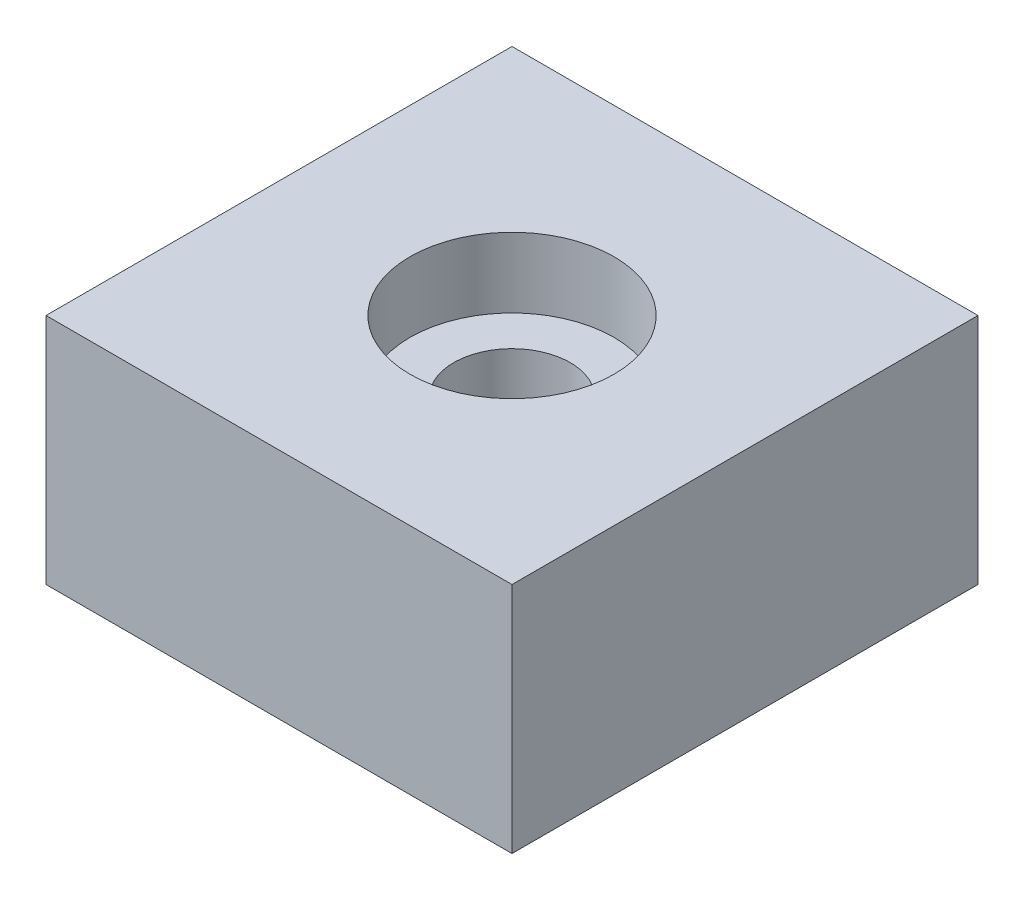
ISO-10303-21;
HEADER;
FILE_DESCRIPTION(('STEP AP214'),'2;1');
FILE_NAME('part.step','',(''),(''),'','','');
FILE_SCHEMA(('AUTOMOTIVE_DESIGN { 1 0 10303 214 1 1 1 1 }'));
ENDSEC;
DATA;
#1=APPLICATION_CONTEXT('core data for automotive mechanical design processes');
#2=APPLICATION_PROTOCOL_DEFINITION('international standard','automotive_design',2000,#1);
#3=PRODUCT_CONTEXT('',#1,'mechanical');
#4=PRODUCT('Part','Part','',(#3));
#5=PRODUCT_RELATED_PRODUCT_CATEGORY('part','',(#4));
#6=PRODUCT_DEFINITION_FORMATION('','',#4);
#7=PRODUCT_DEFINITION_CONTEXT('part definition',#1,'design');
#8=PRODUCT_DEFINITION('design','',#6,#7);
#9=PRODUCT_DEFINITION_SHAPE('','',#8);
#10=(LENGTH_UNIT() NAMED_UNIT(*) SI_UNIT(.MILLI.,.METRE.));
#11=(NAMED_UNIT(*) PLANE_ANGLE_UNIT() SI_UNIT($,.RADIAN.));
#12=(NAMED_UNIT(*) SI_UNIT($,.STERADIAN.) SOLID_ANGLE_UNIT());
#13=UNCERTAINTY_MEASURE_WITH_UNIT(LENGTH_MEASURE(1.E-05),#10,'distance_accuracy_value','');
#14=(GEOMETRIC_REPRESENTATION_CONTEXT(3) GLOBAL_UNCERTAINTY_ASSIGNED_CONTEXT((#13)) GLOBAL_UNIT_ASSIGNED_CONTEXT((#10,
#11,#12)) REPRESENTATION_CONTEXT('',''));
#15=CARTESIAN_POINT('',(0.,0.,0.));
#16=DIRECTION('',(0.,0.,1.));
#17=DIRECTION('',(1.,0.,0.));
#18=AXIS2_PLACEMENT_3D('',#15,#16,#17);
#19=CARTESIAN_POINT('',(25.4,0.,-25.4));
#20=DIRECTION('',(0.,1.,0.));
#21=DIRECTION('',(0.,0.,1.));
#22=AXIS2_PLACEMENT_3D('',#19,#20,#21);
#23=CYLINDRICAL_SURFACE('',#22,6.35);
#24=CARTESIAN_POINT('',(25.4,0.,-25.4));
#25=DIRECTION('',(0.,1.,0.));
#26=DIRECTION('',(0.,0.,1.));
#27=AXIS2_PLACEMENT_3D('',#24,#25,#26);
#28=CIRCLE('',#27,6.35);
#29=CARTESIAN_POINT('',(25.4,0.,-19.05));
#30=VERTEX_POINT('',#29);
#31=EDGE_CURVE('E121',#30,#30,#28,.T.);
#32=ORIENTED_EDGE('',*,*,#31,.F.);
#33=EDGE_LOOP('',(#32));
#34=FACE_BOUND('',#33,.T.);
#35=CARTESIAN_POINT('',(25.4,17.78,-25.4));
#36=DIRECTION('',(0.,1.,0.));
#37=DIRECTION('',(0.,0.,1.));
#38=AXIS2_PLACEMENT_3D('',#35,#36,#37);
#39=CIRCLE('',#38,6.35);
#40=CARTESIAN_POINT('',(25.4,17.78,-19.05));
#41=VERTEX_POINT('',#40);
#42=EDGE_CURVE('E48',#41,#41,#39,.F.);
#43=ORIENTED_EDGE('',*,*,#42,.F.);
#44=EDGE_LOOP('',(#43));
#45=FACE_BOUND('',#44,.T.);
#46=ADVANCED_FACE('F44',(#34,#45),#23,.F.);
#47=CARTESIAN_POINT('',(0.,25.4,0.));
#48=DIRECTION('',(1.,0.,0.));
#49=DIRECTION('',(0.,0.,-1.));
#50=AXIS2_PLACEMENT_3D('',#47,#48,#49);
#51=PLANE('',#50);
#52=DIRECTION('',(0.,0.,1.));
#53=VECTOR('',#52,1.);
#54=CARTESIAN_POINT('',(0.,0.,0.));
#55=LINE('',#54,#53);
#56=CARTESIAN_POINT('',(0.,0.,-50.8));
#57=VERTEX_POINT('',#56);
#58=CARTESIAN_POINT('',(0.,0.,0.));
#59=VERTEX_POINT('',#58);
#60=EDGE_CURVE('E117',#57,#59,#55,.T.);
#61=ORIENTED_EDGE('',*,*,#60,.T.);
#62=DIRECTION('',(0.,-1.,0.));
#63=VECTOR('',#62,1.);
#64=CARTESIAN_POINT('',(0.,25.4,0.));
#65=LINE('',#64,#63);
#66=CARTESIAN_POINT('',(0.,25.4,0.));
#67=VERTEX_POINT('',#66);
#68=EDGE_CURVE('E11',#67,#59,#65,.T.);
#69=ORIENTED_EDGE('',*,*,#68,.F.);
#70=DIRECTION('',(0.,0.,1.));
#71=VECTOR('',#70,1.);
#72=CARTESIAN_POINT('',(0.,25.4,0.));
#73=LINE('',#72,#71);
#74=CARTESIAN_POINT('',(0.,25.4,-50.8));
#75=VERTEX_POINT('',#74);
#76=EDGE_CURVE('E98',#75,#67,#73,.T.);
#77=ORIENTED_EDGE('',*,*,#76,.F.);
#78=DIRECTION('',(0.,-1.,0.));
#79=VECTOR('',#78,1.);
#80=CARTESIAN_POINT('',(0.,25.4,-50.8));
#81=LINE('',#80,#79);
#82=EDGE_CURVE('E113',#75,#57,#81,.T.);
#83=ORIENTED_EDGE('',*,*,#82,.T.);
#84=EDGE_LOOP('',(#61,#69,#77,#83));
#85=FACE_BOUND('',#84,.T.);
#86=ADVANCED_FACE('F46',(#85),#51,.F.);
#87=CARTESIAN_POINT('',(0.,25.4,0.));
#88=DIRECTION('',(0.,0.,-1.));
#89=DIRECTION('',(-1.,0.,0.));
#90=AXIS2_PLACEMENT_3D('',#87,#88,#89);
#91=PLANE('',#90);
#92=DIRECTION('',(1.,0.,0.));
#93=VECTOR('',#92,1.);
#94=CARTESIAN_POINT('',(0.,0.,0.));
#95=LINE('',#94,#93);
#96=CARTESIAN_POINT('',(50.8,0.,0.));
#97=VERTEX_POINT('',#96);
#98=EDGE_CURVE('E103',#59,#97,#95,.T.);
#99=ORIENTED_EDGE('',*,*,#98,.T.);
#100=DIRECTION('',(0.,-1.,0.));
#101=VECTOR('',#100,1.);
#102=CARTESIAN_POINT('',(50.8,25.4,0.));
#103=LINE('',#102,#101);
#104=CARTESIAN_POINT('',(50.8,25.4,0.));
#105=VERTEX_POINT('',#104);
#106=EDGE_CURVE('E55',#105,#97,#103,.T.);
#107=ORIENTED_EDGE('',*,*,#106,.F.);
#108=DIRECTION('',(1.,0.,0.));
#109=VECTOR('',#108,1.);
#110=CARTESIAN_POINT('',(0.,25.4,0.));
#111=LINE('',#110,#109);
#112=EDGE_CURVE('E93',#67,#105,#111,.T.);
#113=ORIENTED_EDGE('',*,*,#112,.F.);
#114=ORIENTED_EDGE('',*,*,#68,.T.);
#115=EDGE_LOOP('',(#99,#107,#113,#114));
#116=FACE_BOUND('',#115,.T.);
#117=ADVANCED_FACE('F102',(#116),#91,.F.);
#118=CARTESIAN_POINT('',(50.8,25.4,0.));
#119=DIRECTION('',(-1.,0.,0.));
#120=DIRECTION('',(0.,0.,1.));
#121=AXIS2_PLACEMENT_3D('',#118,#119,#120);
#122=PLANE('',#121);
#123=DIRECTION('',(0.,0.,-1.));
#124=VECTOR('',#123,1.);
#125=CARTESIAN_POINT('',(50.8,0.,0.));
#126=LINE('',#125,#124);
#127=CARTESIAN_POINT('',(50.8,0.,-50.8));
#128=VERTEX_POINT('',#127);
#129=EDGE_CURVE('E80',#97,#128,#126,.T.);
#130=ORIENTED_EDGE('',*,*,#129,.T.);
#131=DIRECTION('',(0.,-1.,0.));
#132=VECTOR('',#131,1.);
#133=CARTESIAN_POINT('',(50.8,25.4,-50.8));
#134=LINE('',#133,#132);
#135=CARTESIAN_POINT('',(50.8,25.4,-50.8));
#136=VERTEX_POINT('',#135);
#137=EDGE_CURVE('E105',#136,#128,#134,.T.);
#138=ORIENTED_EDGE('',*,*,#137,.F.);
#139=DIRECTION('',(0.,0.,-1.));
#140=VECTOR('',#139,1.);
#141=CARTESIAN_POINT('',(50.8,25.4,0.));
#142=LINE('',#141,#140);
#143=EDGE_CURVE('E96',#105,#136,#142,.T.);
#144=ORIENTED_EDGE('',*,*,#143,.F.);
#145=ORIENTED_EDGE('',*,*,#106,.T.);
#146=EDGE_LOOP('',(#130,#138,#144,#145));
#147=FACE_BOUND('',#146,.T.);
#148=ADVANCED_FACE('F107',(#147),#122,.F.);
#149=CARTESIAN_POINT('',(0.,25.4,-50.8));
#150=DIRECTION('',(0.,0.,1.));
#151=DIRECTION('',(1.,0.,0.));
#152=AXIS2_PLACEMENT_3D('',#149,#150,#151);
#153=PLANE('',#152);
#154=DIRECTION('',(-1.,0.,0.));
#155=VECTOR('',#154,1.);
#156=CARTESIAN_POINT('',(0.,0.,-50.8));
#157=LINE('',#156,#155);
#158=EDGE_CURVE('E86',#128,#57,#157,.T.);
#159=ORIENTED_EDGE('',*,*,#158,.T.);
#160=ORIENTED_EDGE('',*,*,#82,.F.);
#161=DIRECTION('',(-1.,0.,0.));
#162=VECTOR('',#161,1.);
#163=CARTESIAN_POINT('',(0.,25.4,-50.8));
#164=LINE('',#163,#162);
#165=EDGE_CURVE('E63',#136,#75,#164,.T.);
#166=ORIENTED_EDGE('',*,*,#165,.F.);
#167=ORIENTED_EDGE('',*,*,#137,.T.);
#168=EDGE_LOOP('',(#159,#160,#166,#167));
#169=FACE_BOUND('',#168,.T.);
#170=ADVANCED_FACE('F133',(#169),#153,.F.);
#171=CARTESIAN_POINT('',(0.,25.4,0.));
#172=DIRECTION('',(0.,-1.,0.));
#173=DIRECTION('',(0.,0.,-1.));
#174=AXIS2_PLACEMENT_3D('',#171,#172,#173);
#175=PLANE('',#174);
#176=CARTESIAN_POINT('',(25.4,25.4,-25.4));
#177=DIRECTION('',(0.,1.,0.));
#178=DIRECTION('',(0.,0.,1.));
#179=AXIS2_PLACEMENT_3D('',#176,#177,#178);
#180=CIRCLE('',#179,11.1125);
#181=CARTESIAN_POINT('',(25.4,25.4,-14.2875));
#182=VERTEX_POINT('',#181);
#183=EDGE_CURVE('E145',#182,#182,#180,.T.);
#184=ORIENTED_EDGE('',*,*,#183,.F.);
#185=EDGE_LOOP('',(#184));
#186=FACE_BOUND('',#185,.T.);
#187=ORIENTED_EDGE('',*,*,#76,.T.);
#188=ORIENTED_EDGE('',*,*,#112,.T.);
#189=ORIENTED_EDGE('',*,*,#143,.T.);
#190=ORIENTED_EDGE('',*,*,#165,.T.);
#191=EDGE_LOOP('',(#187,#188,#189,#190));
#192=FACE_BOUND('',#191,.T.);
#193=ADVANCED_FACE('F94',(#186,#192),#175,.F.);
#194=CARTESIAN_POINT('',(0.,0.,0.));
#195=DIRECTION('',(0.,-1.,0.));
#196=DIRECTION('',(0.,0.,-1.));
#197=AXIS2_PLACEMENT_3D('',#194,#195,#196);
#198=PLANE('',#197);
#199=ORIENTED_EDGE('',*,*,#31,.T.);
#200=EDGE_LOOP('',(#199));
#201=FACE_BOUND('',#200,.T.);
#202=ORIENTED_EDGE('',*,*,#60,.F.);
#203=ORIENTED_EDGE('',*,*,#158,.F.);
#204=ORIENTED_EDGE('',*,*,#129,.F.);
#205=ORIENTED_EDGE('',*,*,#98,.F.);
#206=EDGE_LOOP('',(#202,#203,#204,#205));
#207=FACE_BOUND('',#206,.T.);
#208=ADVANCED_FACE('F136',(#201,#207),#198,.T.);
#209=CARTESIAN_POINT('',(25.4,17.78,-25.4));
#210=DIRECTION('',(0.,1.,0.));
#211=DIRECTION('',(0.,0.,1.));
#212=AXIS2_PLACEMENT_3D('',#209,#210,#211);
#213=PLANE('',#212);
#214=CARTESIAN_POINT('',(25.4,17.78,-25.4));
#215=DIRECTION('',(0.,1.,0.));
#216=DIRECTION('',(0.,0.,1.));
#217=AXIS2_PLACEMENT_3D('',#214,#215,#216);
#218=CIRCLE('',#217,11.1125);
#219=CARTESIAN_POINT('',(25.4,17.78,-14.2875));
#220=VERTEX_POINT('',#219);
#221=EDGE_CURVE('E149',#220,#220,#218,.T.);
#222=ORIENTED_EDGE('',*,*,#221,.T.);
#223=EDGE_LOOP('',(#222));
#224=FACE_BOUND('',#223,.T.);
#225=ORIENTED_EDGE('',*,*,#42,.T.);
#226=EDGE_LOOP('',(#225));
#227=FACE_BOUND('',#226,.T.);
#228=ADVANCED_FACE('F162',(#224,#227),#213,.T.);
#229=CARTESIAN_POINT('',(25.4,17.78,-25.4));
#230=DIRECTION('',(0.,1.,0.));
#231=DIRECTION('',(0.,0.,1.));
#232=AXIS2_PLACEMENT_3D('',#229,#230,#231);
#233=CYLINDRICAL_SURFACE('',#232,11.1125);
#234=ORIENTED_EDGE('',*,*,#221,.F.);
#235=EDGE_LOOP('',(#234));
#236=FACE_BOUND('',#235,.T.);
#237=ORIENTED_EDGE('',*,*,#183,.T.);
#238=EDGE_LOOP('',(#237));
#239=FACE_BOUND('',#238,.T.);
#240=ADVANCED_FACE('F173',(#236,#239),#233,.F.);
#241=CLOSED_SHELL('',(#46,#86,#117,#148,#170,#193,#208,#228,#240));
#242=MANIFOLD_SOLID_BREP('B2',#241);
#243=ADVANCED_BREP_SHAPE_REPRESENTATION('',(#18,#242),#14);
#244=SHAPE_DEFINITION_REPRESENTATION(#9,#243);
ENDSEC;
END-ISO-10303-21;
